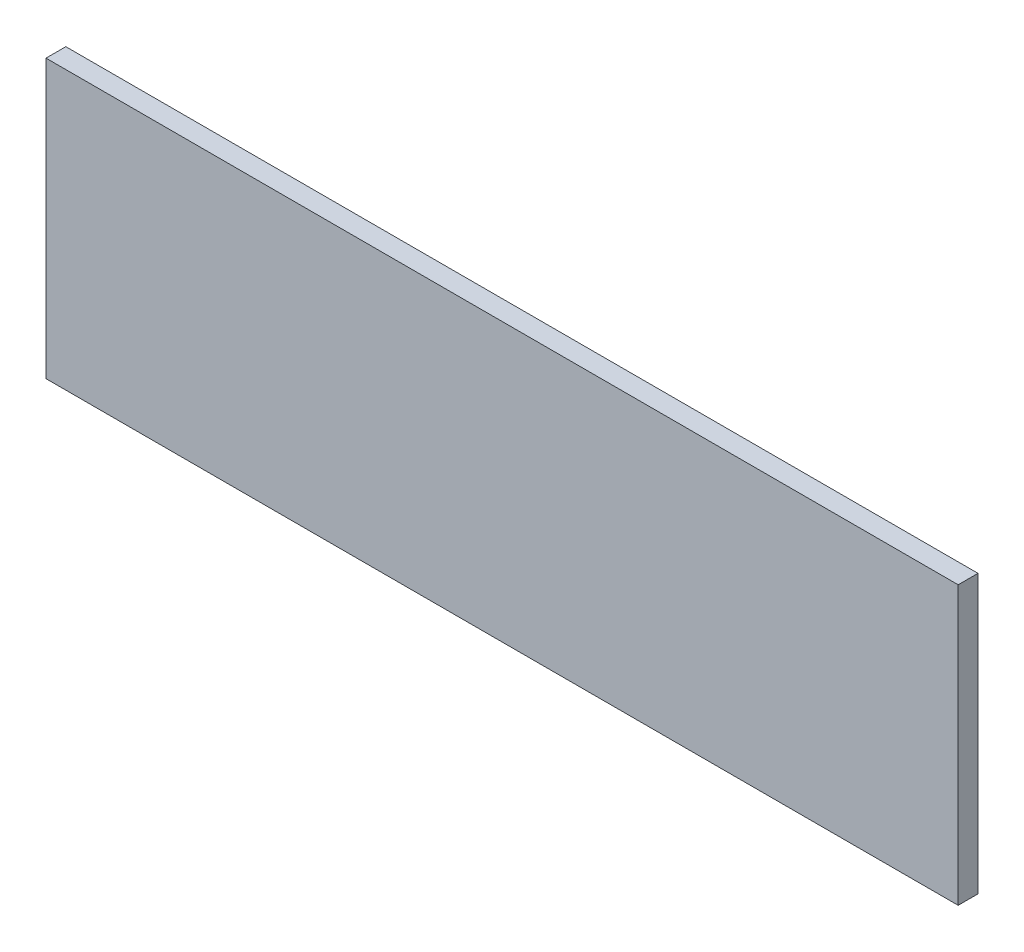
ISO-10303-21;
HEADER;
FILE_DESCRIPTION(('STEP AP214'),'2;1');
FILE_NAME('part.step','',(''),(''),'','','');
FILE_SCHEMA(('AUTOMOTIVE_DESIGN { 1 0 10303 214 1 1 1 1 }'));
ENDSEC;
DATA;
#1=APPLICATION_CONTEXT('core data for automotive mechanical design processes');
#2=APPLICATION_PROTOCOL_DEFINITION('international standard','automotive_design',2000,#1);
#3=PRODUCT_CONTEXT('',#1,'mechanical');
#4=PRODUCT('Part','Part','',(#3));
#5=PRODUCT_RELATED_PRODUCT_CATEGORY('part','',(#4));
#6=PRODUCT_DEFINITION_FORMATION('','',#4);
#7=PRODUCT_DEFINITION_CONTEXT('part definition',#1,'design');
#8=PRODUCT_DEFINITION('design','',#6,#7);
#9=PRODUCT_DEFINITION_SHAPE('','',#8);
#10=(LENGTH_UNIT() NAMED_UNIT(*) SI_UNIT(.MILLI.,.METRE.));
#11=(NAMED_UNIT(*) PLANE_ANGLE_UNIT() SI_UNIT($,.RADIAN.));
#12=(NAMED_UNIT(*) SI_UNIT($,.STERADIAN.) SOLID_ANGLE_UNIT());
#13=UNCERTAINTY_MEASURE_WITH_UNIT(LENGTH_MEASURE(1.E-05),#10,'distance_accuracy_value','');
#14=(GEOMETRIC_REPRESENTATION_CONTEXT(3) GLOBAL_UNCERTAINTY_ASSIGNED_CONTEXT((#13)) GLOBAL_UNIT_ASSIGNED_CONTEXT((#10,
#11,#12)) REPRESENTATION_CONTEXT('',''));
#15=CARTESIAN_POINT('',(0.,0.,0.));
#16=DIRECTION('',(0.,0.,1.));
#17=DIRECTION('',(1.,0.,0.));
#18=AXIS2_PLACEMENT_3D('',#15,#16,#17);
#19=CARTESIAN_POINT('',(0.,0.,6.35));
#20=DIRECTION('',(-1.,0.,0.));
#21=DIRECTION('',(0.,-1.,0.));
#22=AXIS2_PLACEMENT_3D('',#19,#20,#21);
#23=PLANE('',#22);
#24=DIRECTION('',(0.,1.,0.));
#25=VECTOR('',#24,1.);
#26=CARTESIAN_POINT('',(0.,0.,0.));
#27=LINE('',#26,#25);
#28=CARTESIAN_POINT('',(0.,0.,0.));
#29=VERTEX_POINT('',#28);
#30=CARTESIAN_POINT('',(0.,88.9,0.));
#31=VERTEX_POINT('',#30);
#32=EDGE_CURVE('E110',#29,#31,#27,.T.);
#33=ORIENTED_EDGE('',*,*,#32,.F.);
#34=DIRECTION('',(0.,0.,-1.));
#35=VECTOR('',#34,1.);
#36=CARTESIAN_POINT('',(0.,0.,6.35));
#37=LINE('',#36,#35);
#38=CARTESIAN_POINT('',(0.,0.,6.35));
#39=VERTEX_POINT('',#38);
#40=EDGE_CURVE('E11',#39,#29,#37,.T.);
#41=ORIENTED_EDGE('',*,*,#40,.F.);
#42=DIRECTION('',(0.,1.,0.));
#43=VECTOR('',#42,1.);
#44=CARTESIAN_POINT('',(0.,0.,6.35));
#45=LINE('',#44,#43);
#46=CARTESIAN_POINT('',(0.,88.9,6.35));
#47=VERTEX_POINT('',#46);
#48=EDGE_CURVE('E103',#39,#47,#45,.T.);
#49=ORIENTED_EDGE('',*,*,#48,.T.);
#50=DIRECTION('',(0.,0.,-1.));
#51=VECTOR('',#50,1.);
#52=CARTESIAN_POINT('',(0.,88.9,6.35));
#53=LINE('',#52,#51);
#54=EDGE_CURVE('E42',#47,#31,#53,.T.);
#55=ORIENTED_EDGE('',*,*,#54,.T.);
#56=EDGE_LOOP('',(#33,#41,#49,#55));
#57=FACE_BOUND('',#56,.T.);
#58=ADVANCED_FACE('F39',(#57),#23,.T.);
#59=CARTESIAN_POINT('',(0.,0.,6.35));
#60=DIRECTION('',(0.,1.,0.));
#61=DIRECTION('',(0.,0.,1.));
#62=AXIS2_PLACEMENT_3D('',#59,#60,#61);
#63=PLANE('',#62);
#64=DIRECTION('',(1.,0.,0.));
#65=VECTOR('',#64,1.);
#66=CARTESIAN_POINT('',(0.,0.,0.));
#67=LINE('',#66,#65);
#68=CARTESIAN_POINT('',(292.1,0.,0.));
#69=VERTEX_POINT('',#68);
#70=EDGE_CURVE('E73',#29,#69,#67,.T.);
#71=ORIENTED_EDGE('',*,*,#70,.T.);
#72=DIRECTION('',(0.,0.,-1.));
#73=VECTOR('',#72,1.);
#74=CARTESIAN_POINT('',(292.1,0.,6.35));
#75=LINE('',#74,#73);
#76=CARTESIAN_POINT('',(292.1,0.,6.35));
#77=VERTEX_POINT('',#76);
#78=EDGE_CURVE('E49',#77,#69,#75,.T.);
#79=ORIENTED_EDGE('',*,*,#78,.F.);
#80=DIRECTION('',(1.,0.,0.));
#81=VECTOR('',#80,1.);
#82=CARTESIAN_POINT('',(0.,0.,6.35));
#83=LINE('',#82,#81);
#84=EDGE_CURVE('E90',#39,#77,#83,.T.);
#85=ORIENTED_EDGE('',*,*,#84,.F.);
#86=ORIENTED_EDGE('',*,*,#40,.T.);
#87=EDGE_LOOP('',(#71,#79,#85,#86));
#88=FACE_BOUND('',#87,.T.);
#89=ADVANCED_FACE('F126',(#88),#63,.F.);
#90=CARTESIAN_POINT('',(292.1,0.,6.35));
#91=DIRECTION('',(-1.,0.,0.));
#92=DIRECTION('',(0.,-1.,0.));
#93=AXIS2_PLACEMENT_3D('',#90,#91,#92);
#94=PLANE('',#93);
#95=DIRECTION('',(0.,1.,0.));
#96=VECTOR('',#95,1.);
#97=CARTESIAN_POINT('',(292.1,0.,0.));
#98=LINE('',#97,#96);
#99=CARTESIAN_POINT('',(292.1,88.9,0.));
#100=VERTEX_POINT('',#99);
#101=EDGE_CURVE('E98',#69,#100,#98,.T.);
#102=ORIENTED_EDGE('',*,*,#101,.T.);
#103=DIRECTION('',(0.,0.,-1.));
#104=VECTOR('',#103,1.);
#105=CARTESIAN_POINT('',(292.1,88.9,6.35));
#106=LINE('',#105,#104);
#107=CARTESIAN_POINT('',(292.1,88.9,6.35));
#108=VERTEX_POINT('',#107);
#109=EDGE_CURVE('E95',#108,#100,#106,.T.);
#110=ORIENTED_EDGE('',*,*,#109,.F.);
#111=DIRECTION('',(0.,1.,0.));
#112=VECTOR('',#111,1.);
#113=CARTESIAN_POINT('',(292.1,0.,6.35));
#114=LINE('',#113,#112);
#115=EDGE_CURVE('E85',#77,#108,#114,.T.);
#116=ORIENTED_EDGE('',*,*,#115,.F.);
#117=ORIENTED_EDGE('',*,*,#78,.T.);
#118=EDGE_LOOP('',(#102,#110,#116,#117));
#119=FACE_BOUND('',#118,.T.);
#120=ADVANCED_FACE('F96',(#119),#94,.F.);
#121=CARTESIAN_POINT('',(0.,88.9,6.35));
#122=DIRECTION('',(0.,1.,0.));
#123=DIRECTION('',(0.,0.,1.));
#124=AXIS2_PLACEMENT_3D('',#121,#122,#123);
#125=PLANE('',#124);
#126=DIRECTION('',(1.,0.,0.));
#127=VECTOR('',#126,1.);
#128=CARTESIAN_POINT('',(0.,88.9,0.));
#129=LINE('',#128,#127);
#130=EDGE_CURVE('E114',#31,#100,#129,.T.);
#131=ORIENTED_EDGE('',*,*,#130,.F.);
#132=ORIENTED_EDGE('',*,*,#54,.F.);
#133=DIRECTION('',(1.,0.,0.));
#134=VECTOR('',#133,1.);
#135=CARTESIAN_POINT('',(0.,88.9,6.35));
#136=LINE('',#135,#134);
#137=EDGE_CURVE('E89',#47,#108,#136,.T.);
#138=ORIENTED_EDGE('',*,*,#137,.T.);
#139=ORIENTED_EDGE('',*,*,#109,.T.);
#140=EDGE_LOOP('',(#131,#132,#138,#139));
#141=FACE_BOUND('',#140,.T.);
#142=ADVANCED_FACE('F101',(#141),#125,.T.);
#143=CARTESIAN_POINT('',(0.,0.,6.35));
#144=DIRECTION('',(0.,0.,-1.));
#145=DIRECTION('',(-1.,0.,0.));
#146=AXIS2_PLACEMENT_3D('',#143,#144,#145);
#147=PLANE('',#146);
#148=ORIENTED_EDGE('',*,*,#48,.F.);
#149=ORIENTED_EDGE('',*,*,#84,.T.);
#150=ORIENTED_EDGE('',*,*,#115,.T.);
#151=ORIENTED_EDGE('',*,*,#137,.F.);
#152=EDGE_LOOP('',(#148,#149,#150,#151));
#153=FACE_BOUND('',#152,.T.);
#154=ADVANCED_FACE('F88',(#153),#147,.F.);
#155=CARTESIAN_POINT('',(0.,0.,0.));
#156=DIRECTION('',(0.,0.,-1.));
#157=DIRECTION('',(-1.,0.,0.));
#158=AXIS2_PLACEMENT_3D('',#155,#156,#157);
#159=PLANE('',#158);
#160=ORIENTED_EDGE('',*,*,#32,.T.);
#161=ORIENTED_EDGE('',*,*,#130,.T.);
#162=ORIENTED_EDGE('',*,*,#101,.F.);
#163=ORIENTED_EDGE('',*,*,#70,.F.);
#164=EDGE_LOOP('',(#160,#161,#162,#163));
#165=FACE_BOUND('',#164,.T.);
#166=ADVANCED_FACE('F123',(#165),#159,.T.);
#167=CLOSED_SHELL('',(#58,#89,#120,#142,#154,#166));
#168=MANIFOLD_SOLID_BREP('B2',#167);
#169=ADVANCED_BREP_SHAPE_REPRESENTATION('',(#18,#168),#14);
#170=SHAPE_DEFINITION_REPRESENTATION(#9,#169);
ENDSEC;
END-ISO-10303-21;
